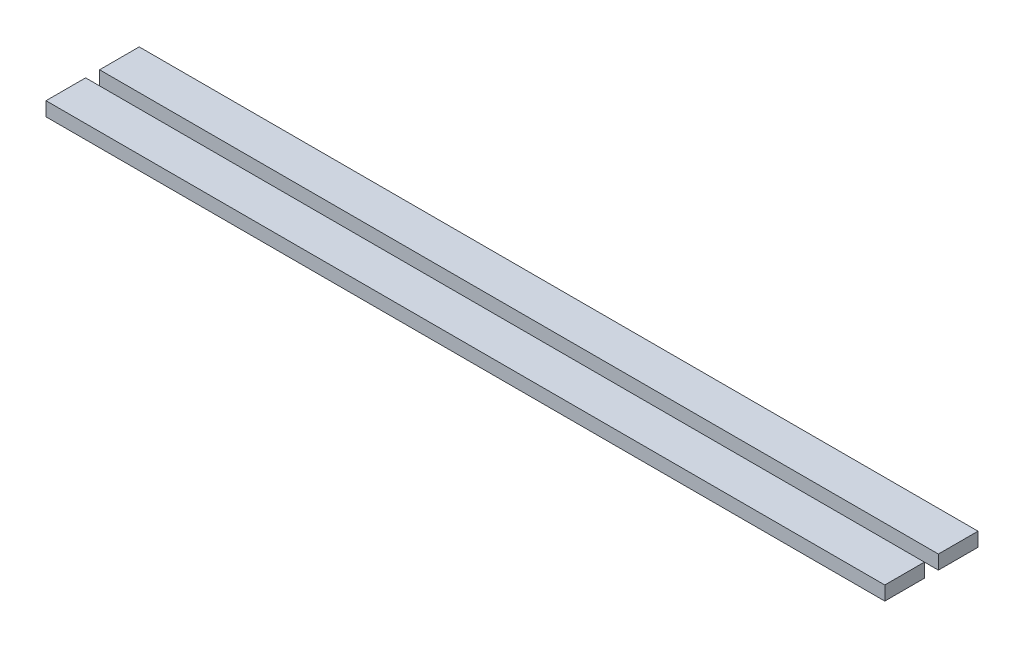
ISO-10303-21;
HEADER;
FILE_DESCRIPTION(('STEP AP214'),'2;1');
FILE_NAME('part.step','',(''),(''),'','','');
FILE_SCHEMA(('AUTOMOTIVE_DESIGN { 1 0 10303 214 1 1 1 1 }'));
ENDSEC;
DATA;
#1=APPLICATION_CONTEXT('core data for automotive mechanical design processes');
#2=APPLICATION_PROTOCOL_DEFINITION('international standard','automotive_design',2000,#1);
#3=PRODUCT_CONTEXT('',#1,'mechanical');
#4=PRODUCT('Part','Part','',(#3));
#5=PRODUCT_RELATED_PRODUCT_CATEGORY('part','',(#4));
#6=PRODUCT_DEFINITION_FORMATION('','',#4);
#7=PRODUCT_DEFINITION_CONTEXT('part definition',#1,'design');
#8=PRODUCT_DEFINITION('design','',#6,#7);
#9=PRODUCT_DEFINITION_SHAPE('','',#8);
#10=(LENGTH_UNIT() NAMED_UNIT(*) SI_UNIT(.MILLI.,.METRE.));
#11=(NAMED_UNIT(*) PLANE_ANGLE_UNIT() SI_UNIT($,.RADIAN.));
#12=(NAMED_UNIT(*) SI_UNIT($,.STERADIAN.) SOLID_ANGLE_UNIT());
#13=UNCERTAINTY_MEASURE_WITH_UNIT(LENGTH_MEASURE(1.E-05),#10,'distance_accuracy_value','');
#14=(GEOMETRIC_REPRESENTATION_CONTEXT(3) GLOBAL_UNCERTAINTY_ASSIGNED_CONTEXT((#13)) GLOBAL_UNIT_ASSIGNED_CONTEXT((#10,
#11,#12)) REPRESENTATION_CONTEXT('',''));
#15=CARTESIAN_POINT('',(0.,0.,0.));
#16=DIRECTION('',(0.,0.,1.));
#17=DIRECTION('',(1.,0.,0.));
#18=AXIS2_PLACEMENT_3D('',#15,#16,#17);
#19=CARTESIAN_POINT('',(-74.7169811320754,3.,-39.9056603773585));
#20=DIRECTION('',(1.,0.,0.));
#21=DIRECTION('',(0.,0.,-1.));
#22=AXIS2_PLACEMENT_3D('',#19,#20,#21);
#23=PLANE('',#22);
#24=DIRECTION('',(0.,-1.,0.));
#25=VECTOR('',#24,1.);
#26=CARTESIAN_POINT('',(-74.7169811320754,13.,-28.4056603773585));
#27=LINE('',#26,#25);
#28=CARTESIAN_POINT('',(-74.7169811320754,3.,-28.4056603773585));
#29=VERTEX_POINT('',#28);
#30=CARTESIAN_POINT('',(-74.7169811320754,0.,-28.4056603773585));
#31=VERTEX_POINT('',#30);
#32=EDGE_CURVE('E80',#29,#31,#27,.T.);
#33=ORIENTED_EDGE('',*,*,#32,.T.);
#34=DIRECTION('',(0.,0.,1.));
#35=VECTOR('',#34,1.);
#36=CARTESIAN_POINT('',(-74.7169811320754,0.,-39.9056603773585));
#37=LINE('',#36,#35);
#38=CARTESIAN_POINT('',(-74.7169811320754,0.,-19.9056603773585));
#39=VERTEX_POINT('',#38);
#40=EDGE_CURVE('E45',#31,#39,#37,.T.);
#41=ORIENTED_EDGE('',*,*,#40,.T.);
#42=DIRECTION('',(0.,-1.,0.));
#43=VECTOR('',#42,1.);
#44=CARTESIAN_POINT('',(-74.7169811320754,3.,-19.9056603773585));
#45=LINE('',#44,#43);
#46=CARTESIAN_POINT('',(-74.7169811320754,3.,-19.9056603773585));
#47=VERTEX_POINT('',#46);
#48=EDGE_CURVE('E51',#47,#39,#45,.T.);
#49=ORIENTED_EDGE('',*,*,#48,.F.);
#50=DIRECTION('',(0.,0.,1.));
#51=VECTOR('',#50,1.);
#52=CARTESIAN_POINT('',(-74.7169811320754,3.,-39.9056603773585));
#53=LINE('',#52,#51);
#54=EDGE_CURVE('E92',#29,#47,#53,.T.);
#55=ORIENTED_EDGE('',*,*,#54,.F.);
#56=EDGE_LOOP('',(#33,#41,#49,#55));
#57=FACE_BOUND('',#56,.T.);
#58=ADVANCED_FACE('F42',(#57),#23,.F.);
#59=CARTESIAN_POINT('',(105.283018867925,3.,-39.9056603773585));
#60=DIRECTION('',(-1.,0.,0.));
#61=DIRECTION('',(0.,0.,1.));
#62=AXIS2_PLACEMENT_3D('',#59,#60,#61);
#63=PLANE('',#62);
#64=DIRECTION('',(0.,-1.,0.));
#65=VECTOR('',#64,1.);
#66=CARTESIAN_POINT('',(105.283018867925,13.,-28.4056603773585));
#67=LINE('',#66,#65);
#68=CARTESIAN_POINT('',(105.283018867925,3.,-28.4056603773585));
#69=VERTEX_POINT('',#68);
#70=CARTESIAN_POINT('',(105.283018867925,0.,-28.4056603773585));
#71=VERTEX_POINT('',#70);
#72=EDGE_CURVE('E12',#69,#71,#67,.T.);
#73=ORIENTED_EDGE('',*,*,#72,.F.);
#74=DIRECTION('',(0.,0.,-1.));
#75=VECTOR('',#74,1.);
#76=CARTESIAN_POINT('',(105.283018867925,3.,-39.9056603773585));
#77=LINE('',#76,#75);
#78=CARTESIAN_POINT('',(105.283018867925,3.,-19.9056603773585));
#79=VERTEX_POINT('',#78);
#80=EDGE_CURVE('E103',#79,#69,#77,.T.);
#81=ORIENTED_EDGE('',*,*,#80,.F.);
#82=DIRECTION('',(0.,-1.,0.));
#83=VECTOR('',#82,1.);
#84=CARTESIAN_POINT('',(105.283018867925,3.,-19.9056603773585));
#85=LINE('',#84,#83);
#86=CARTESIAN_POINT('',(105.283018867925,0.,-19.9056603773585));
#87=VERTEX_POINT('',#86);
#88=EDGE_CURVE('E96',#79,#87,#85,.T.);
#89=ORIENTED_EDGE('',*,*,#88,.T.);
#90=DIRECTION('',(0.,0.,-1.));
#91=VECTOR('',#90,1.);
#92=CARTESIAN_POINT('',(105.283018867925,0.,-39.9056603773585));
#93=LINE('',#92,#91);
#94=EDGE_CURVE('E98',#87,#71,#93,.T.);
#95=ORIENTED_EDGE('',*,*,#94,.T.);
#96=EDGE_LOOP('',(#73,#81,#89,#95));
#97=FACE_BOUND('',#96,.T.);
#98=ADVANCED_FACE('F116',(#97),#63,.F.);
#99=CARTESIAN_POINT('',(0.,3.,0.));
#100=DIRECTION('',(0.,1.,0.));
#101=DIRECTION('',(0.,0.,1.));
#102=AXIS2_PLACEMENT_3D('',#99,#100,#101);
#103=PLANE('',#102);
#104=ORIENTED_EDGE('',*,*,#80,.T.);
#105=DIRECTION('',(-1.,0.,0.));
#106=VECTOR('',#105,1.);
#107=CARTESIAN_POINT('',(0.,3.,-28.4056603773585));
#108=LINE('',#107,#106);
#109=EDGE_CURVE('E58',#69,#29,#108,.T.);
#110=ORIENTED_EDGE('',*,*,#109,.T.);
#111=ORIENTED_EDGE('',*,*,#54,.T.);
#112=DIRECTION('',(1.,0.,0.));
#113=VECTOR('',#112,1.);
#114=CARTESIAN_POINT('',(-74.7169811320754,3.,-19.9056603773585));
#115=LINE('',#114,#113);
#116=EDGE_CURVE('E86',#47,#79,#115,.T.);
#117=ORIENTED_EDGE('',*,*,#116,.T.);
#118=EDGE_LOOP('',(#104,#110,#111,#117));
#119=FACE_BOUND('',#118,.T.);
#120=ADVANCED_FACE('F113',(#119),#103,.T.);
#121=CARTESIAN_POINT('',(0.,0.,0.));
#122=DIRECTION('',(0.,1.,0.));
#123=DIRECTION('',(0.,0.,1.));
#124=AXIS2_PLACEMENT_3D('',#121,#122,#123);
#125=PLANE('',#124);
#126=DIRECTION('',(1.,0.,0.));
#127=VECTOR('',#126,1.);
#128=CARTESIAN_POINT('',(-74.7169811320754,0.,-28.4056603773585));
#129=LINE('',#128,#127);
#130=EDGE_CURVE('E77',#31,#71,#129,.T.);
#131=ORIENTED_EDGE('',*,*,#130,.T.);
#132=ORIENTED_EDGE('',*,*,#94,.F.);
#133=DIRECTION('',(1.,0.,0.));
#134=VECTOR('',#133,1.);
#135=CARTESIAN_POINT('',(-74.7169811320754,0.,-19.9056603773585));
#136=LINE('',#135,#134);
#137=EDGE_CURVE('E85',#39,#87,#136,.T.);
#138=ORIENTED_EDGE('',*,*,#137,.F.);
#139=ORIENTED_EDGE('',*,*,#40,.F.);
#140=EDGE_LOOP('',(#131,#132,#138,#139));
#141=FACE_BOUND('',#140,.T.);
#142=ADVANCED_FACE('F94',(#141),#125,.F.);
#143=CARTESIAN_POINT('',(-74.7169811320754,3.,-19.9056603773585));
#144=DIRECTION('',(0.,0.,-1.));
#145=DIRECTION('',(-1.,0.,0.));
#146=AXIS2_PLACEMENT_3D('',#143,#144,#145);
#147=PLANE('',#146);
#148=ORIENTED_EDGE('',*,*,#137,.T.);
#149=ORIENTED_EDGE('',*,*,#88,.F.);
#150=ORIENTED_EDGE('',*,*,#116,.F.);
#151=ORIENTED_EDGE('',*,*,#48,.T.);
#152=EDGE_LOOP('',(#148,#149,#150,#151));
#153=FACE_BOUND('',#152,.T.);
#154=ADVANCED_FACE('F115',(#153),#147,.F.);
#155=CARTESIAN_POINT('',(-74.7169811320754,13.,-28.4056603773585));
#156=DIRECTION('',(0.,0.,-1.));
#157=DIRECTION('',(-1.,0.,0.));
#158=AXIS2_PLACEMENT_3D('',#155,#156,#157);
#159=PLANE('',#158);
#160=ORIENTED_EDGE('',*,*,#72,.T.);
#161=ORIENTED_EDGE('',*,*,#130,.F.);
#162=ORIENTED_EDGE('',*,*,#32,.F.);
#163=ORIENTED_EDGE('',*,*,#109,.F.);
#164=EDGE_LOOP('',(#160,#161,#162,#163));
#165=FACE_BOUND('',#164,.T.);
#166=ADVANCED_FACE('F79',(#165),#159,.T.);
#167=CLOSED_SHELL('',(#58,#98,#120,#142,#154,#166));
#168=MANIFOLD_SOLID_BREP('B2',#167);
#169=CARTESIAN_POINT('',(-74.7169811320754,3.,-39.9056603773585));
#170=DIRECTION('',(0.,0.,1.));
#171=DIRECTION('',(1.,0.,0.));
#172=AXIS2_PLACEMENT_3D('',#169,#170,#171);
#173=PLANE('',#172);
#174=DIRECTION('',(-1.,0.,0.));
#175=VECTOR('',#174,1.);
#176=CARTESIAN_POINT('',(-74.7169811320754,0.,-39.9056603773585));
#177=LINE('',#176,#175);
#178=CARTESIAN_POINT('',(105.283018867925,0.,-39.9056603773585));
#179=VERTEX_POINT('',#178);
#180=CARTESIAN_POINT('',(-74.7169811320754,0.,-39.9056603773585));
#181=VERTEX_POINT('',#180);
#182=EDGE_CURVE('E201',#179,#181,#177,.T.);
#183=ORIENTED_EDGE('',*,*,#182,.T.);
#184=DIRECTION('',(0.,-1.,0.));
#185=VECTOR('',#184,1.);
#186=CARTESIAN_POINT('',(-74.7169811320754,3.,-39.9056603773585));
#187=LINE('',#186,#185);
#188=CARTESIAN_POINT('',(-74.7169811320754,3.,-39.9056603773585));
#189=VERTEX_POINT('',#188);
#190=EDGE_CURVE('E173',#189,#181,#187,.T.);
#191=ORIENTED_EDGE('',*,*,#190,.F.);
#192=DIRECTION('',(-1.,0.,0.));
#193=VECTOR('',#192,1.);
#194=CARTESIAN_POINT('',(-74.7169811320754,3.,-39.9056603773585));
#195=LINE('',#194,#193);
#196=CARTESIAN_POINT('',(105.283018867925,3.,-39.9056603773585));
#197=VERTEX_POINT('',#196);
#198=EDGE_CURVE('E189',#197,#189,#195,.T.);
#199=ORIENTED_EDGE('',*,*,#198,.F.);
#200=DIRECTION('',(0.,-1.,0.));
#201=VECTOR('',#200,1.);
#202=CARTESIAN_POINT('',(105.283018867925,3.,-39.9056603773585));
#203=LINE('',#202,#201);
#204=EDGE_CURVE('E40',#197,#179,#203,.T.);
#205=ORIENTED_EDGE('',*,*,#204,.T.);
#206=EDGE_LOOP('',(#183,#191,#199,#205));
#207=FACE_BOUND('',#206,.T.);
#208=ADVANCED_FACE('F165',(#207),#173,.F.);
#209=CARTESIAN_POINT('',(0.,3.,0.));
#210=DIRECTION('',(0.,1.,0.));
#211=DIRECTION('',(0.,0.,1.));
#212=AXIS2_PLACEMENT_3D('',#209,#210,#211);
#213=PLANE('',#212);
#214=DIRECTION('',(0.,0.,1.));
#215=VECTOR('',#214,1.);
#216=CARTESIAN_POINT('',(-74.7169811320754,3.,-39.9056603773585));
#217=LINE('',#216,#215);
#218=CARTESIAN_POINT('',(-74.7169811320754,3.,-31.4056603773585));
#219=VERTEX_POINT('',#218);
#220=EDGE_CURVE('E208',#189,#219,#217,.T.);
#221=ORIENTED_EDGE('',*,*,#220,.T.);
#222=DIRECTION('',(1.,0.,0.));
#223=VECTOR('',#222,1.);
#224=CARTESIAN_POINT('',(0.,3.,-31.4056603773585));
#225=LINE('',#224,#223);
#226=CARTESIAN_POINT('',(105.283018867925,3.,-31.4056603773585));
#227=VERTEX_POINT('',#226);
#228=EDGE_CURVE('E216',#219,#227,#225,.T.);
#229=ORIENTED_EDGE('',*,*,#228,.T.);
#230=DIRECTION('',(0.,0.,-1.));
#231=VECTOR('',#230,1.);
#232=CARTESIAN_POINT('',(105.283018867925,3.,-39.9056603773585));
#233=LINE('',#232,#231);
#234=EDGE_CURVE('E224',#227,#197,#233,.T.);
#235=ORIENTED_EDGE('',*,*,#234,.T.);
#236=ORIENTED_EDGE('',*,*,#198,.T.);
#237=EDGE_LOOP('',(#221,#229,#235,#236));
#238=FACE_BOUND('',#237,.T.);
#239=ADVANCED_FACE('F239',(#238),#213,.T.);
#240=CARTESIAN_POINT('',(0.,0.,0.));
#241=DIRECTION('',(0.,1.,0.));
#242=DIRECTION('',(0.,0.,1.));
#243=AXIS2_PLACEMENT_3D('',#240,#241,#242);
#244=PLANE('',#243);
#245=DIRECTION('',(-1.,0.,0.));
#246=VECTOR('',#245,1.);
#247=CARTESIAN_POINT('',(-74.7169811320754,0.,-31.4056603773585));
#248=LINE('',#247,#246);
#249=CARTESIAN_POINT('',(105.283018867925,0.,-31.4056603773585));
#250=VERTEX_POINT('',#249);
#251=CARTESIAN_POINT('',(-74.7169811320754,0.,-31.4056603773585));
#252=VERTEX_POINT('',#251);
#253=EDGE_CURVE('E215',#250,#252,#248,.T.);
#254=ORIENTED_EDGE('',*,*,#253,.T.);
#255=DIRECTION('',(0.,0.,1.));
#256=VECTOR('',#255,1.);
#257=CARTESIAN_POINT('',(-74.7169811320754,0.,-39.9056603773585));
#258=LINE('',#257,#256);
#259=EDGE_CURVE('E213',#181,#252,#258,.T.);
#260=ORIENTED_EDGE('',*,*,#259,.F.);
#261=ORIENTED_EDGE('',*,*,#182,.F.);
#262=DIRECTION('',(0.,0.,-1.));
#263=VECTOR('',#262,1.);
#264=CARTESIAN_POINT('',(105.283018867925,0.,-39.9056603773585));
#265=LINE('',#264,#263);
#266=EDGE_CURVE('E209',#250,#179,#265,.T.);
#267=ORIENTED_EDGE('',*,*,#266,.F.);
#268=EDGE_LOOP('',(#254,#260,#261,#267));
#269=FACE_BOUND('',#268,.T.);
#270=ADVANCED_FACE('F214',(#269),#244,.F.);
#271=CARTESIAN_POINT('',(105.283018867925,3.,-39.9056603773585));
#272=DIRECTION('',(-1.,0.,0.));
#273=DIRECTION('',(0.,0.,1.));
#274=AXIS2_PLACEMENT_3D('',#271,#272,#273);
#275=PLANE('',#274);
#276=DIRECTION('',(0.,-1.,0.));
#277=VECTOR('',#276,1.);
#278=CARTESIAN_POINT('',(105.283018867925,13.,-31.4056603773585));
#279=LINE('',#278,#277);
#280=EDGE_CURVE('E220',#227,#250,#279,.T.);
#281=ORIENTED_EDGE('',*,*,#280,.T.);
#282=ORIENTED_EDGE('',*,*,#266,.T.);
#283=ORIENTED_EDGE('',*,*,#204,.F.);
#284=ORIENTED_EDGE('',*,*,#234,.F.);
#285=EDGE_LOOP('',(#281,#282,#283,#284));
#286=FACE_BOUND('',#285,.T.);
#287=ADVANCED_FACE('F234',(#286),#275,.F.);
#288=CARTESIAN_POINT('',(-74.7169811320754,3.,-39.9056603773585));
#289=DIRECTION('',(1.,0.,0.));
#290=DIRECTION('',(0.,0.,-1.));
#291=AXIS2_PLACEMENT_3D('',#288,#289,#290);
#292=PLANE('',#291);
#293=DIRECTION('',(0.,-1.,0.));
#294=VECTOR('',#293,1.);
#295=CARTESIAN_POINT('',(-74.7169811320754,13.,-31.4056603773585));
#296=LINE('',#295,#294);
#297=EDGE_CURVE('E180',#219,#252,#296,.T.);
#298=ORIENTED_EDGE('',*,*,#297,.F.);
#299=ORIENTED_EDGE('',*,*,#220,.F.);
#300=ORIENTED_EDGE('',*,*,#190,.T.);
#301=ORIENTED_EDGE('',*,*,#259,.T.);
#302=EDGE_LOOP('',(#298,#299,#300,#301));
#303=FACE_BOUND('',#302,.T.);
#304=ADVANCED_FACE('F167',(#303),#292,.F.);
#305=CARTESIAN_POINT('',(-74.7169811320754,13.,-31.4056603773585));
#306=DIRECTION('',(0.,0.,1.));
#307=DIRECTION('',(1.,0.,0.));
#308=AXIS2_PLACEMENT_3D('',#305,#306,#307);
#309=PLANE('',#308);
#310=ORIENTED_EDGE('',*,*,#297,.T.);
#311=ORIENTED_EDGE('',*,*,#253,.F.);
#312=ORIENTED_EDGE('',*,*,#280,.F.);
#313=ORIENTED_EDGE('',*,*,#228,.F.);
#314=EDGE_LOOP('',(#310,#311,#312,#313));
#315=FACE_BOUND('',#314,.T.);
#316=ADVANCED_FACE('F237',(#315),#309,.T.);
#317=CLOSED_SHELL('',(#208,#239,#270,#287,#304,#316));
#318=MANIFOLD_SOLID_BREP('B6',#317);
#319=ADVANCED_BREP_SHAPE_REPRESENTATION('',(#18,#168,#318),#14);
#320=SHAPE_DEFINITION_REPRESENTATION(#9,#319);
ENDSEC;
END-ISO-10303-21;
